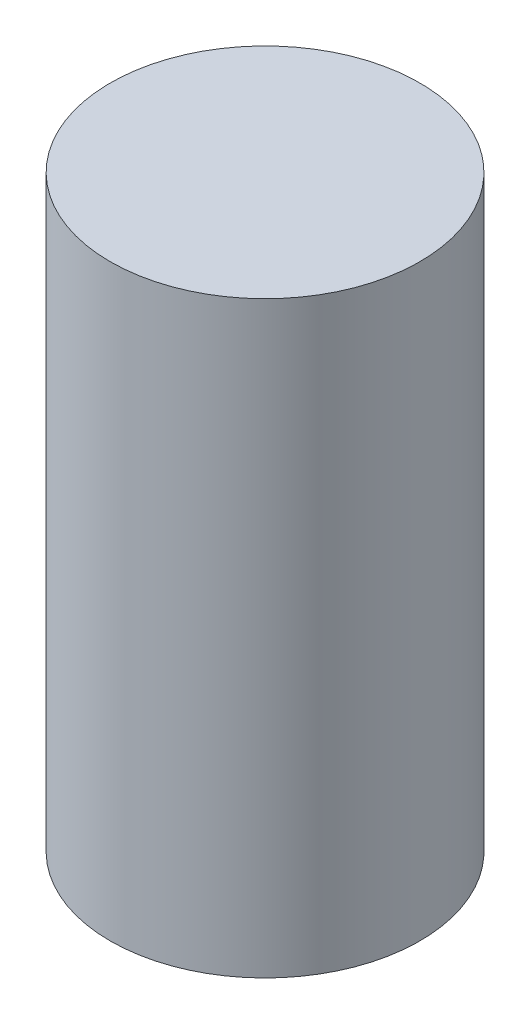
ISO-10303-21;
HEADER;
FILE_DESCRIPTION(('STEP AP214'),'2;1');
FILE_NAME('part.step','',(''),(''),'','','');
FILE_SCHEMA(('AUTOMOTIVE_DESIGN { 1 0 10303 214 1 1 1 1 }'));
ENDSEC;
DATA;
#1=APPLICATION_CONTEXT('core data for automotive mechanical design processes');
#2=APPLICATION_PROTOCOL_DEFINITION('international standard','automotive_design',2000,#1);
#3=PRODUCT_CONTEXT('',#1,'mechanical');
#4=PRODUCT('Part','Part','',(#3));
#5=PRODUCT_RELATED_PRODUCT_CATEGORY('part','',(#4));
#6=PRODUCT_DEFINITION_FORMATION('','',#4);
#7=PRODUCT_DEFINITION_CONTEXT('part definition',#1,'design');
#8=PRODUCT_DEFINITION('design','',#6,#7);
#9=PRODUCT_DEFINITION_SHAPE('','',#8);
#10=(LENGTH_UNIT() NAMED_UNIT(*) SI_UNIT(.MILLI.,.METRE.));
#11=(NAMED_UNIT(*) PLANE_ANGLE_UNIT() SI_UNIT($,.RADIAN.));
#12=(NAMED_UNIT(*) SI_UNIT($,.STERADIAN.) SOLID_ANGLE_UNIT());
#13=UNCERTAINTY_MEASURE_WITH_UNIT(LENGTH_MEASURE(1.E-05),#10,'distance_accuracy_value','');
#14=(GEOMETRIC_REPRESENTATION_CONTEXT(3) GLOBAL_UNCERTAINTY_ASSIGNED_CONTEXT((#13)) GLOBAL_UNIT_ASSIGNED_CONTEXT((#10,
#11,#12)) REPRESENTATION_CONTEXT('',''));
#15=CARTESIAN_POINT('',(0.,0.,0.));
#16=DIRECTION('',(0.,0.,1.));
#17=DIRECTION('',(1.,0.,0.));
#18=AXIS2_PLACEMENT_3D('',#15,#16,#17);
#19=CARTESIAN_POINT('',(0.,24.13,0.));
#20=DIRECTION('',(0.,-1.,0.));
#21=DIRECTION('',(0.,0.,-1.));
#22=AXIS2_PLACEMENT_3D('',#19,#20,#21);
#23=CYLINDRICAL_SURFACE('',#22,6.35);
#24=CARTESIAN_POINT('',(0.,24.13,0.));
#25=DIRECTION('',(0.,1.,0.));
#26=DIRECTION('',(0.,0.,1.));
#27=AXIS2_PLACEMENT_3D('',#24,#25,#26);
#28=CIRCLE('',#27,6.35);
#29=CARTESIAN_POINT('',(0.,24.13,6.35));
#30=VERTEX_POINT('',#29);
#31=EDGE_CURVE('E10',#30,#30,#28,.T.);
#32=ORIENTED_EDGE('',*,*,#31,.F.);
#33=EDGE_LOOP('',(#32));
#34=FACE_BOUND('',#33,.T.);
#35=CARTESIAN_POINT('',(0.,0.,0.));
#36=DIRECTION('',(0.,1.,0.));
#37=DIRECTION('',(0.,0.,1.));
#38=AXIS2_PLACEMENT_3D('',#35,#36,#37);
#39=CIRCLE('',#38,6.35);
#40=CARTESIAN_POINT('',(0.,0.,6.35));
#41=VERTEX_POINT('',#40);
#42=EDGE_CURVE('E44',#41,#41,#39,.T.);
#43=ORIENTED_EDGE('',*,*,#42,.T.);
#44=EDGE_LOOP('',(#43));
#45=FACE_BOUND('',#44,.T.);
#46=ADVANCED_FACE('F41',(#34,#45),#23,.T.);
#47=CARTESIAN_POINT('',(0.,24.13,0.));
#48=DIRECTION('',(0.,1.,0.));
#49=DIRECTION('',(0.,0.,1.));
#50=AXIS2_PLACEMENT_3D('',#47,#48,#49);
#51=PLANE('',#50);
#52=ORIENTED_EDGE('',*,*,#31,.T.);
#53=EDGE_LOOP('',(#52));
#54=FACE_BOUND('',#53,.T.);
#55=ADVANCED_FACE('F58',(#54),#51,.T.);
#56=CARTESIAN_POINT('',(0.,0.,0.));
#57=DIRECTION('',(0.,1.,0.));
#58=DIRECTION('',(0.,0.,1.));
#59=AXIS2_PLACEMENT_3D('',#56,#57,#58);
#60=PLANE('',#59);
#61=ORIENTED_EDGE('',*,*,#42,.F.);
#62=EDGE_LOOP('',(#61));
#63=FACE_BOUND('',#62,.T.);
#64=ADVANCED_FACE('F56',(#63),#60,.F.);
#65=CLOSED_SHELL('',(#46,#55,#64));
#66=MANIFOLD_SOLID_BREP('B2',#65);
#67=ADVANCED_BREP_SHAPE_REPRESENTATION('',(#18,#66),#14);
#68=SHAPE_DEFINITION_REPRESENTATION(#9,#67);
ENDSEC;
END-ISO-10303-21;
